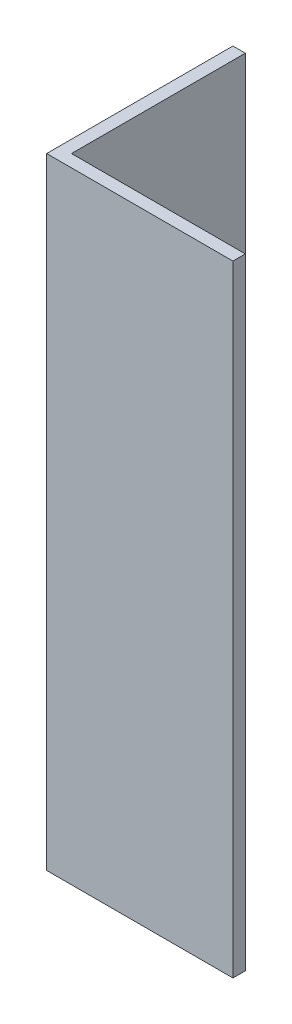
ISO-10303-21;
HEADER;
FILE_DESCRIPTION(('STEP AP214'),'2;1');
FILE_NAME('part.step','',(''),(''),'','','');
FILE_SCHEMA(('AUTOMOTIVE_DESIGN { 1 0 10303 214 1 1 1 1 }'));
ENDSEC;
DATA;
#1=APPLICATION_CONTEXT('core data for automotive mechanical design processes');
#2=APPLICATION_PROTOCOL_DEFINITION('international standard','automotive_design',2000,#1);
#3=PRODUCT_CONTEXT('',#1,'mechanical');
#4=PRODUCT('Part','Part','',(#3));
#5=PRODUCT_RELATED_PRODUCT_CATEGORY('part','',(#4));
#6=PRODUCT_DEFINITION_FORMATION('','',#4);
#7=PRODUCT_DEFINITION_CONTEXT('part definition',#1,'design');
#8=PRODUCT_DEFINITION('design','',#6,#7);
#9=PRODUCT_DEFINITION_SHAPE('','',#8);
#10=(LENGTH_UNIT() NAMED_UNIT(*) SI_UNIT(.MILLI.,.METRE.));
#11=(NAMED_UNIT(*) PLANE_ANGLE_UNIT() SI_UNIT($,.RADIAN.));
#12=(NAMED_UNIT(*) SI_UNIT($,.STERADIAN.) SOLID_ANGLE_UNIT());
#13=UNCERTAINTY_MEASURE_WITH_UNIT(LENGTH_MEASURE(1.E-05),#10,'distance_accuracy_value','');
#14=(GEOMETRIC_REPRESENTATION_CONTEXT(3) GLOBAL_UNCERTAINTY_ASSIGNED_CONTEXT((#13)) GLOBAL_UNIT_ASSIGNED_CONTEXT((#10,
#11,#12)) REPRESENTATION_CONTEXT('',''));
#15=CARTESIAN_POINT('',(0.,0.,0.));
#16=DIRECTION('',(0.,0.,1.));
#17=DIRECTION('',(1.,0.,0.));
#18=AXIS2_PLACEMENT_3D('',#15,#16,#17);
#19=CARTESIAN_POINT('',(15.,50.,0.));
#20=DIRECTION('',(0.,0.,-1.));
#21=DIRECTION('',(-1.,0.,0.));
#22=AXIS2_PLACEMENT_3D('',#19,#20,#21);
#23=PLANE('',#22);
#24=DIRECTION('',(1.,0.,0.));
#25=VECTOR('',#24,1.);
#26=CARTESIAN_POINT('',(15.,0.,0.));
#27=LINE('',#26,#25);
#28=CARTESIAN_POINT('',(0.,0.,0.));
#29=VERTEX_POINT('',#28);
#30=CARTESIAN_POINT('',(15.,0.,0.));
#31=VERTEX_POINT('',#30);
#32=EDGE_CURVE('E117',#29,#31,#27,.T.);
#33=ORIENTED_EDGE('',*,*,#32,.T.);
#34=DIRECTION('',(0.,-1.,0.));
#35=VECTOR('',#34,1.);
#36=CARTESIAN_POINT('',(15.,50.,0.));
#37=LINE('',#36,#35);
#38=CARTESIAN_POINT('',(15.,50.,0.));
#39=VERTEX_POINT('',#38);
#40=EDGE_CURVE('E11',#39,#31,#37,.T.);
#41=ORIENTED_EDGE('',*,*,#40,.F.);
#42=DIRECTION('',(1.,0.,0.));
#43=VECTOR('',#42,1.);
#44=CARTESIAN_POINT('',(15.,50.,0.));
#45=LINE('',#44,#43);
#46=CARTESIAN_POINT('',(0.,50.,0.));
#47=VERTEX_POINT('',#46);
#48=EDGE_CURVE('E127',#47,#39,#45,.T.);
#49=ORIENTED_EDGE('',*,*,#48,.F.);
#50=DIRECTION('',(0.,-1.,0.));
#51=VECTOR('',#50,1.);
#52=CARTESIAN_POINT('',(0.,50.,0.));
#53=LINE('',#52,#51);
#54=EDGE_CURVE('E113',#47,#29,#53,.T.);
#55=ORIENTED_EDGE('',*,*,#54,.T.);
#56=EDGE_LOOP('',(#33,#41,#49,#55));
#57=FACE_BOUND('',#56,.T.);
#58=ADVANCED_FACE('F33',(#57),#23,.F.);
#59=CARTESIAN_POINT('',(15.,50.,-0.999999999999998));
#60=DIRECTION('',(-1.,0.,0.));
#61=DIRECTION('',(0.,0.,1.));
#62=AXIS2_PLACEMENT_3D('',#59,#60,#61);
#63=PLANE('',#62);
#64=DIRECTION('',(0.,0.,-1.));
#65=VECTOR('',#64,1.);
#66=CARTESIAN_POINT('',(15.,0.,-0.999999999999998));
#67=LINE('',#66,#65);
#68=CARTESIAN_POINT('',(15.,0.,-0.999999999999998));
#69=VERTEX_POINT('',#68);
#70=EDGE_CURVE('E120',#31,#69,#67,.T.);
#71=ORIENTED_EDGE('',*,*,#70,.T.);
#72=DIRECTION('',(0.,-1.,0.));
#73=VECTOR('',#72,1.);
#74=CARTESIAN_POINT('',(15.,50.,-0.999999999999998));
#75=LINE('',#74,#73);
#76=CARTESIAN_POINT('',(15.,50.,-0.999999999999998));
#77=VERTEX_POINT('',#76);
#78=EDGE_CURVE('E41',#77,#69,#75,.T.);
#79=ORIENTED_EDGE('',*,*,#78,.F.);
#80=DIRECTION('',(0.,0.,-1.));
#81=VECTOR('',#80,1.);
#82=CARTESIAN_POINT('',(15.,50.,-0.999999999999998));
#83=LINE('',#82,#81);
#84=EDGE_CURVE('E86',#39,#77,#83,.T.);
#85=ORIENTED_EDGE('',*,*,#84,.F.);
#86=ORIENTED_EDGE('',*,*,#40,.T.);
#87=EDGE_LOOP('',(#71,#79,#85,#86));
#88=FACE_BOUND('',#87,.T.);
#89=ADVANCED_FACE('F151',(#88),#63,.F.);
#90=CARTESIAN_POINT('',(1.,50.,-0.999999999999997));
#91=DIRECTION('',(0.,0.,1.));
#92=DIRECTION('',(1.,0.,0.));
#93=AXIS2_PLACEMENT_3D('',#90,#91,#92);
#94=PLANE('',#93);
#95=DIRECTION('',(-1.,0.,0.));
#96=VECTOR('',#95,1.);
#97=CARTESIAN_POINT('',(1.,0.,-0.999999999999997));
#98=LINE('',#97,#96);
#99=CARTESIAN_POINT('',(1.,0.,-0.999999999999997));
#100=VERTEX_POINT('',#99);
#101=EDGE_CURVE('E122',#69,#100,#98,.T.);
#102=ORIENTED_EDGE('',*,*,#101,.T.);
#103=DIRECTION('',(0.,-1.,0.));
#104=VECTOR('',#103,1.);
#105=CARTESIAN_POINT('',(1.,50.,-0.999999999999997));
#106=LINE('',#105,#104);
#107=CARTESIAN_POINT('',(1.,50.,-0.999999999999997));
#108=VERTEX_POINT('',#107);
#109=EDGE_CURVE('E108',#108,#100,#106,.T.);
#110=ORIENTED_EDGE('',*,*,#109,.F.);
#111=DIRECTION('',(-1.,0.,0.));
#112=VECTOR('',#111,1.);
#113=CARTESIAN_POINT('',(1.,50.,-0.999999999999997));
#114=LINE('',#113,#112);
#115=EDGE_CURVE('E99',#77,#108,#114,.T.);
#116=ORIENTED_EDGE('',*,*,#115,.F.);
#117=ORIENTED_EDGE('',*,*,#78,.T.);
#118=EDGE_LOOP('',(#102,#110,#116,#117));
#119=FACE_BOUND('',#118,.T.);
#120=ADVANCED_FACE('F133',(#119),#94,.F.);
#121=CARTESIAN_POINT('',(0.999999999999998,50.,-15.));
#122=DIRECTION('',(-1.,0.,0.));
#123=DIRECTION('',(0.,0.,1.));
#124=AXIS2_PLACEMENT_3D('',#121,#122,#123);
#125=PLANE('',#124);
#126=DIRECTION('',(0.,0.,-1.));
#127=VECTOR('',#126,1.);
#128=CARTESIAN_POINT('',(0.999999999999998,0.,-15.));
#129=LINE('',#128,#127);
#130=CARTESIAN_POINT('',(0.999999999999998,0.,-15.));
#131=VERTEX_POINT('',#130);
#132=EDGE_CURVE('E107',#100,#131,#129,.T.);
#133=ORIENTED_EDGE('',*,*,#132,.T.);
#134=DIRECTION('',(0.,-1.,0.));
#135=VECTOR('',#134,1.);
#136=CARTESIAN_POINT('',(0.999999999999998,50.,-15.));
#137=LINE('',#136,#135);
#138=CARTESIAN_POINT('',(0.999999999999998,50.,-15.));
#139=VERTEX_POINT('',#138);
#140=EDGE_CURVE('E104',#139,#131,#137,.T.);
#141=ORIENTED_EDGE('',*,*,#140,.F.);
#142=DIRECTION('',(0.,0.,-1.));
#143=VECTOR('',#142,1.);
#144=CARTESIAN_POINT('',(0.999999999999998,50.,-15.));
#145=LINE('',#144,#143);
#146=EDGE_CURVE('E93',#108,#139,#145,.T.);
#147=ORIENTED_EDGE('',*,*,#146,.F.);
#148=ORIENTED_EDGE('',*,*,#109,.T.);
#149=EDGE_LOOP('',(#133,#141,#147,#148));
#150=FACE_BOUND('',#149,.T.);
#151=ADVANCED_FACE('F105',(#150),#125,.F.);
#152=CARTESIAN_POINT('',(0.,50.,-15.));
#153=DIRECTION('',(0.,0.,1.));
#154=DIRECTION('',(1.,0.,0.));
#155=AXIS2_PLACEMENT_3D('',#152,#153,#154);
#156=PLANE('',#155);
#157=DIRECTION('',(-1.,0.,0.));
#158=VECTOR('',#157,1.);
#159=CARTESIAN_POINT('',(0.,0.,-15.));
#160=LINE('',#159,#158);
#161=CARTESIAN_POINT('',(0.,0.,-15.));
#162=VERTEX_POINT('',#161);
#163=EDGE_CURVE('E72',#131,#162,#160,.T.);
#164=ORIENTED_EDGE('',*,*,#163,.T.);
#165=DIRECTION('',(0.,-1.,0.));
#166=VECTOR('',#165,1.);
#167=CARTESIAN_POINT('',(0.,50.,-15.));
#168=LINE('',#167,#166);
#169=CARTESIAN_POINT('',(0.,50.,-15.));
#170=VERTEX_POINT('',#169);
#171=EDGE_CURVE('E109',#170,#162,#168,.T.);
#172=ORIENTED_EDGE('',*,*,#171,.F.);
#173=DIRECTION('',(-1.,0.,0.));
#174=VECTOR('',#173,1.);
#175=CARTESIAN_POINT('',(0.,50.,-15.));
#176=LINE('',#175,#174);
#177=EDGE_CURVE('E97',#139,#170,#176,.T.);
#178=ORIENTED_EDGE('',*,*,#177,.F.);
#179=ORIENTED_EDGE('',*,*,#140,.T.);
#180=EDGE_LOOP('',(#164,#172,#178,#179));
#181=FACE_BOUND('',#180,.T.);
#182=ADVANCED_FACE('F111',(#181),#156,.F.);
#183=CARTESIAN_POINT('',(0.,50.,0.));
#184=DIRECTION('',(1.,0.,0.));
#185=DIRECTION('',(0.,0.,-1.));
#186=AXIS2_PLACEMENT_3D('',#183,#184,#185);
#187=PLANE('',#186);
#188=DIRECTION('',(0.,0.,1.));
#189=VECTOR('',#188,1.);
#190=CARTESIAN_POINT('',(0.,0.,0.));
#191=LINE('',#190,#189);
#192=EDGE_CURVE('E78',#162,#29,#191,.T.);
#193=ORIENTED_EDGE('',*,*,#192,.T.);
#194=ORIENTED_EDGE('',*,*,#54,.F.);
#195=DIRECTION('',(0.,0.,1.));
#196=VECTOR('',#195,1.);
#197=CARTESIAN_POINT('',(0.,50.,0.));
#198=LINE('',#197,#196);
#199=EDGE_CURVE('E49',#170,#47,#198,.T.);
#200=ORIENTED_EDGE('',*,*,#199,.F.);
#201=ORIENTED_EDGE('',*,*,#171,.T.);
#202=EDGE_LOOP('',(#193,#194,#200,#201));
#203=FACE_BOUND('',#202,.T.);
#204=ADVANCED_FACE('F140',(#203),#187,.F.);
#205=CARTESIAN_POINT('',(0.,50.,0.));
#206=DIRECTION('',(0.,-1.,0.));
#207=DIRECTION('',(0.,0.,-1.));
#208=AXIS2_PLACEMENT_3D('',#205,#206,#207);
#209=PLANE('',#208);
#210=ORIENTED_EDGE('',*,*,#48,.T.);
#211=ORIENTED_EDGE('',*,*,#84,.T.);
#212=ORIENTED_EDGE('',*,*,#115,.T.);
#213=ORIENTED_EDGE('',*,*,#146,.T.);
#214=ORIENTED_EDGE('',*,*,#177,.T.);
#215=ORIENTED_EDGE('',*,*,#199,.T.);
#216=EDGE_LOOP('',(#210,#211,#212,#213,#214,#215));
#217=FACE_BOUND('',#216,.T.);
#218=ADVANCED_FACE('F95',(#217),#209,.F.);
#219=CARTESIAN_POINT('',(0.,0.,0.));
#220=DIRECTION('',(0.,-1.,0.));
#221=DIRECTION('',(0.,0.,-1.));
#222=AXIS2_PLACEMENT_3D('',#219,#220,#221);
#223=PLANE('',#222);
#224=ORIENTED_EDGE('',*,*,#32,.F.);
#225=ORIENTED_EDGE('',*,*,#192,.F.);
#226=ORIENTED_EDGE('',*,*,#163,.F.);
#227=ORIENTED_EDGE('',*,*,#132,.F.);
#228=ORIENTED_EDGE('',*,*,#101,.F.);
#229=ORIENTED_EDGE('',*,*,#70,.F.);
#230=EDGE_LOOP('',(#224,#225,#226,#227,#228,#229));
#231=FACE_BOUND('',#230,.T.);
#232=ADVANCED_FACE('F136',(#231),#223,.T.);
#233=CLOSED_SHELL('',(#58,#89,#120,#151,#182,#204,#218,#232));
#234=MANIFOLD_SOLID_BREP('B2',#233);
#235=ADVANCED_BREP_SHAPE_REPRESENTATION('',(#18,#234),#14);
#236=SHAPE_DEFINITION_REPRESENTATION(#9,#235);
ENDSEC;
END-ISO-10303-21;
